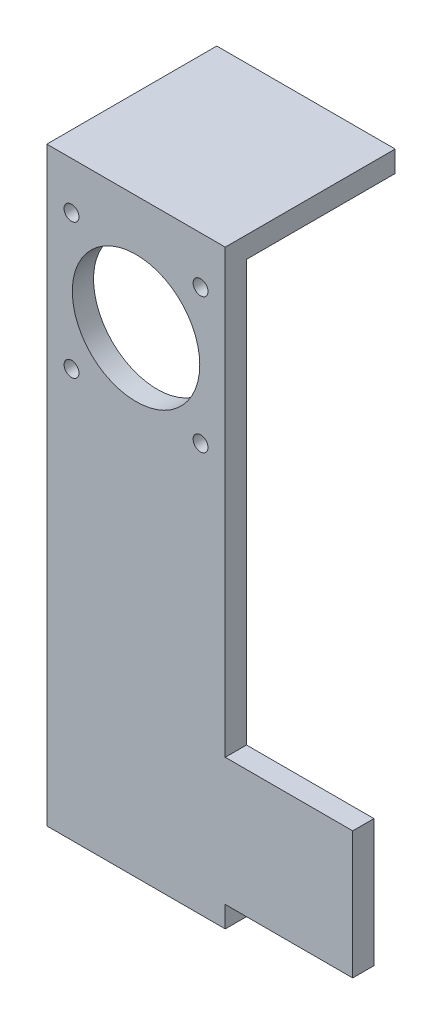
ISO-10303-21;
HEADER;
FILE_DESCRIPTION(('STEP AP214'),'2;1');
FILE_NAME('part.step','',(''),(''),'','','');
FILE_SCHEMA(('AUTOMOTIVE_DESIGN { 1 0 10303 214 1 1 1 1 }'));
ENDSEC;
DATA;
#1=APPLICATION_CONTEXT('core data for automotive mechanical design processes');
#2=APPLICATION_PROTOCOL_DEFINITION('international standard','automotive_design',2000,#1);
#3=PRODUCT_CONTEXT('',#1,'mechanical');
#4=PRODUCT('Part','Part','',(#3));
#5=PRODUCT_RELATED_PRODUCT_CATEGORY('part','',(#4));
#6=PRODUCT_DEFINITION_FORMATION('','',#4);
#7=PRODUCT_DEFINITION_CONTEXT('part definition',#1,'design');
#8=PRODUCT_DEFINITION('design','',#6,#7);
#9=PRODUCT_DEFINITION_SHAPE('','',#8);
#10=(LENGTH_UNIT() NAMED_UNIT(*) SI_UNIT(.MILLI.,.METRE.));
#11=(NAMED_UNIT(*) PLANE_ANGLE_UNIT() SI_UNIT($,.RADIAN.));
#12=(NAMED_UNIT(*) SI_UNIT($,.STERADIAN.) SOLID_ANGLE_UNIT());
#13=UNCERTAINTY_MEASURE_WITH_UNIT(LENGTH_MEASURE(1.E-05),#10,'distance_accuracy_value','');
#14=(GEOMETRIC_REPRESENTATION_CONTEXT(3) GLOBAL_UNCERTAINTY_ASSIGNED_CONTEXT((#13)) GLOBAL_UNIT_ASSIGNED_CONTEXT((#10,
#11,#12)) REPRESENTATION_CONTEXT('',''));
#15=CARTESIAN_POINT('',(0.,0.,0.));
#16=DIRECTION('',(0.,0.,1.));
#17=DIRECTION('',(1.,0.,0.));
#18=AXIS2_PLACEMENT_3D('',#15,#16,#17);
#19=CARTESIAN_POINT('',(51.,0.,5.));
#20=DIRECTION('',(-1.,0.,0.));
#21=DIRECTION('',(0.,0.,1.));
#22=AXIS2_PLACEMENT_3D('',#19,#20,#21);
#23=PLANE('',#22);
#24=DIRECTION('',(0.,1.,0.));
#25=VECTOR('',#24,1.);
#26=CARTESIAN_POINT('',(51.,0.,0.));
#27=LINE('',#26,#25);
#28=CARTESIAN_POINT('',(51.,-107.,0.));
#29=VERTEX_POINT('',#28);
#30=CARTESIAN_POINT('',(51.,-77.,0.));
#31=VERTEX_POINT('',#30);
#32=EDGE_CURVE('E156',#29,#31,#27,.T.);
#33=ORIENTED_EDGE('',*,*,#32,.T.);
#34=DIRECTION('',(0.,0.,-1.));
#35=VECTOR('',#34,1.);
#36=CARTESIAN_POINT('',(51.,-77.,5.));
#37=LINE('',#36,#35);
#38=CARTESIAN_POINT('',(51.,-77.,5.));
#39=VERTEX_POINT('',#38);
#40=EDGE_CURVE('E11',#39,#31,#37,.T.);
#41=ORIENTED_EDGE('',*,*,#40,.F.);
#42=DIRECTION('',(0.,1.,0.));
#43=VECTOR('',#42,1.);
#44=CARTESIAN_POINT('',(51.,0.,5.));
#45=LINE('',#44,#43);
#46=CARTESIAN_POINT('',(51.,-107.,5.));
#47=VERTEX_POINT('',#46);
#48=EDGE_CURVE('E148',#47,#39,#45,.T.);
#49=ORIENTED_EDGE('',*,*,#48,.F.);
#50=DIRECTION('',(0.,0.,-1.));
#51=VECTOR('',#50,1.);
#52=CARTESIAN_POINT('',(51.,-107.,5.));
#53=LINE('',#52,#51);
#54=EDGE_CURVE('E58',#47,#29,#53,.T.);
#55=ORIENTED_EDGE('',*,*,#54,.T.);
#56=EDGE_LOOP('',(#33,#41,#49,#55));
#57=FACE_BOUND('',#56,.T.);
#58=ADVANCED_FACE('F41',(#57),#23,.F.);
#59=CARTESIAN_POINT('',(0.,-77.,5.));
#60=DIRECTION('',(0.,-1.,0.));
#61=DIRECTION('',(0.,0.,-1.));
#62=AXIS2_PLACEMENT_3D('',#59,#60,#61);
#63=PLANE('',#62);
#64=DIRECTION('',(-1.,0.,0.));
#65=VECTOR('',#64,1.);
#66=CARTESIAN_POINT('',(0.,-77.,0.));
#67=LINE('',#66,#65);
#68=CARTESIAN_POINT('',(21.,-77.,0.));
#69=VERTEX_POINT('',#68);
#70=EDGE_CURVE('E265',#31,#69,#67,.T.);
#71=ORIENTED_EDGE('',*,*,#70,.T.);
#72=DIRECTION('',(0.,0.,-1.));
#73=VECTOR('',#72,1.);
#74=CARTESIAN_POINT('',(21.,-77.,5.));
#75=LINE('',#74,#73);
#76=CARTESIAN_POINT('',(21.,-77.,5.));
#77=VERTEX_POINT('',#76);
#78=EDGE_CURVE('E50',#77,#69,#75,.T.);
#79=ORIENTED_EDGE('',*,*,#78,.F.);
#80=DIRECTION('',(-1.,0.,0.));
#81=VECTOR('',#80,1.);
#82=CARTESIAN_POINT('',(0.,-77.,5.));
#83=LINE('',#82,#81);
#84=EDGE_CURVE('E94',#39,#77,#83,.T.);
#85=ORIENTED_EDGE('',*,*,#84,.F.);
#86=ORIENTED_EDGE('',*,*,#40,.T.);
#87=EDGE_LOOP('',(#71,#79,#85,#86));
#88=FACE_BOUND('',#87,.T.);
#89=ADVANCED_FACE('F266',(#88),#63,.F.);
#90=CARTESIAN_POINT('',(21.,0.,5.));
#91=DIRECTION('',(1.,0.,0.));
#92=DIRECTION('',(0.,1.,0.));
#93=AXIS2_PLACEMENT_3D('',#90,#91,#92);
#94=PLANE('',#93);
#95=DIRECTION('',(0.,-1.,0.));
#96=VECTOR('',#95,1.);
#97=CARTESIAN_POINT('',(21.,0.,0.));
#98=LINE('',#97,#96);
#99=CARTESIAN_POINT('',(21.,22.,0.));
#100=VERTEX_POINT('',#99);
#101=EDGE_CURVE('E221',#100,#69,#98,.T.);
#102=ORIENTED_EDGE('',*,*,#101,.F.);
#103=DIRECTION('',(0.,0.,1.));
#104=VECTOR('',#103,1.);
#105=CARTESIAN_POINT('',(21.,22.,-35.));
#106=LINE('',#105,#104);
#107=CARTESIAN_POINT('',(21.,22.,-35.));
#108=VERTEX_POINT('',#107);
#109=EDGE_CURVE('E153',#108,#100,#106,.T.);
#110=ORIENTED_EDGE('',*,*,#109,.F.);
#111=DIRECTION('',(0.,-1.,0.));
#112=VECTOR('',#111,1.);
#113=CARTESIAN_POINT('',(21.,22.,-35.));
#114=LINE('',#113,#112);
#115=CARTESIAN_POINT('',(21.,27.,-35.));
#116=VERTEX_POINT('',#115);
#117=EDGE_CURVE('E180',#116,#108,#114,.T.);
#118=ORIENTED_EDGE('',*,*,#117,.F.);
#119=DIRECTION('',(0.,0.,1.));
#120=VECTOR('',#119,1.);
#121=CARTESIAN_POINT('',(21.,27.,-35.));
#122=LINE('',#121,#120);
#123=CARTESIAN_POINT('',(21.,27.,5.));
#124=VERTEX_POINT('',#123);
#125=EDGE_CURVE('E165',#116,#124,#122,.T.);
#126=ORIENTED_EDGE('',*,*,#125,.T.);
#127=DIRECTION('',(0.,-1.,0.));
#128=VECTOR('',#127,1.);
#129=CARTESIAN_POINT('',(21.,0.,5.));
#130=LINE('',#129,#128);
#131=EDGE_CURVE('E135',#124,#77,#130,.T.);
#132=ORIENTED_EDGE('',*,*,#131,.T.);
#133=ORIENTED_EDGE('',*,*,#78,.T.);
#134=EDGE_LOOP('',(#102,#110,#118,#126,#132,#133));
#135=FACE_BOUND('',#134,.T.);
#136=ADVANCED_FACE('F264',(#135),#94,.T.);
#137=CARTESIAN_POINT('',(-21.,0.,5.));
#138=DIRECTION('',(1.,0.,0.));
#139=DIRECTION('',(0.,1.,0.));
#140=AXIS2_PLACEMENT_3D('',#137,#138,#139);
#141=PLANE('',#140);
#142=DIRECTION('',(0.,-1.,0.));
#143=VECTOR('',#142,1.);
#144=CARTESIAN_POINT('',(-21.,0.,0.));
#145=LINE('',#144,#143);
#146=CARTESIAN_POINT('',(-21.,22.,0.));
#147=VERTEX_POINT('',#146);
#148=CARTESIAN_POINT('',(-21.,-112.,0.));
#149=VERTEX_POINT('',#148);
#150=EDGE_CURVE('E220',#147,#149,#145,.T.);
#151=ORIENTED_EDGE('',*,*,#150,.T.);
#152=DIRECTION('',(0.,0.,-1.));
#153=VECTOR('',#152,1.);
#154=CARTESIAN_POINT('',(-21.,-112.,5.));
#155=LINE('',#154,#153);
#156=CARTESIAN_POINT('',(-21.,-112.,5.));
#157=VERTEX_POINT('',#156);
#158=EDGE_CURVE('E129',#157,#149,#155,.T.);
#159=ORIENTED_EDGE('',*,*,#158,.F.);
#160=DIRECTION('',(0.,-1.,0.));
#161=VECTOR('',#160,1.);
#162=CARTESIAN_POINT('',(-21.,0.,5.));
#163=LINE('',#162,#161);
#164=CARTESIAN_POINT('',(-21.,27.,5.));
#165=VERTEX_POINT('',#164);
#166=EDGE_CURVE('E115',#165,#157,#163,.T.);
#167=ORIENTED_EDGE('',*,*,#166,.F.);
#168=DIRECTION('',(0.,0.,1.));
#169=VECTOR('',#168,1.);
#170=CARTESIAN_POINT('',(-21.,27.,-35.));
#171=LINE('',#170,#169);
#172=CARTESIAN_POINT('',(-21.,27.,-35.));
#173=VERTEX_POINT('',#172);
#174=EDGE_CURVE('E161',#173,#165,#171,.T.);
#175=ORIENTED_EDGE('',*,*,#174,.F.);
#176=DIRECTION('',(0.,1.,0.));
#177=VECTOR('',#176,1.);
#178=CARTESIAN_POINT('',(-21.,22.,-35.));
#179=LINE('',#178,#177);
#180=CARTESIAN_POINT('',(-21.,22.,-35.));
#181=VERTEX_POINT('',#180);
#182=EDGE_CURVE('E172',#181,#173,#179,.T.);
#183=ORIENTED_EDGE('',*,*,#182,.F.);
#184=DIRECTION('',(0.,0.,1.));
#185=VECTOR('',#184,1.);
#186=CARTESIAN_POINT('',(-21.,22.,-35.));
#187=LINE('',#186,#185);
#188=EDGE_CURVE('E157',#181,#147,#187,.T.);
#189=ORIENTED_EDGE('',*,*,#188,.T.);
#190=EDGE_LOOP('',(#151,#159,#167,#175,#183,#189));
#191=FACE_BOUND('',#190,.T.);
#192=ADVANCED_FACE('F223',(#191),#141,.F.);
#193=CARTESIAN_POINT('',(0.,-112.,5.));
#194=DIRECTION('',(0.,1.,0.));
#195=DIRECTION('',(0.,0.,1.));
#196=AXIS2_PLACEMENT_3D('',#193,#194,#195);
#197=PLANE('',#196);
#198=DIRECTION('',(1.,0.,0.));
#199=VECTOR('',#198,1.);
#200=CARTESIAN_POINT('',(0.,-112.,0.));
#201=LINE('',#200,#199);
#202=CARTESIAN_POINT('',(21.,-112.,0.));
#203=VERTEX_POINT('',#202);
#204=EDGE_CURVE('E125',#149,#203,#201,.T.);
#205=ORIENTED_EDGE('',*,*,#204,.T.);
#206=DIRECTION('',(0.,0.,-1.));
#207=VECTOR('',#206,1.);
#208=CARTESIAN_POINT('',(21.,-112.,5.));
#209=LINE('',#208,#207);
#210=CARTESIAN_POINT('',(21.,-112.,5.));
#211=VERTEX_POINT('',#210);
#212=EDGE_CURVE('E122',#211,#203,#209,.T.);
#213=ORIENTED_EDGE('',*,*,#212,.F.);
#214=DIRECTION('',(1.,0.,0.));
#215=VECTOR('',#214,1.);
#216=CARTESIAN_POINT('',(0.,-112.,5.));
#217=LINE('',#216,#215);
#218=EDGE_CURVE('E106',#157,#211,#217,.T.);
#219=ORIENTED_EDGE('',*,*,#218,.F.);
#220=ORIENTED_EDGE('',*,*,#158,.T.);
#221=EDGE_LOOP('',(#205,#213,#219,#220));
#222=FACE_BOUND('',#221,.T.);
#223=ADVANCED_FACE('F123',(#222),#197,.F.);
#224=CARTESIAN_POINT('',(21.,-107.,0.));
#225=VERTEX_POINT('',#224);
#226=EDGE_CURVE('E229',#225,#203,#98,.T.);
#227=ORIENTED_EDGE('',*,*,#226,.F.);
#228=DIRECTION('',(0.,0.,-1.));
#229=VECTOR('',#228,1.);
#230=CARTESIAN_POINT('',(21.,-107.,5.));
#231=LINE('',#230,#229);
#232=CARTESIAN_POINT('',(21.,-107.,5.));
#233=VERTEX_POINT('',#232);
#234=EDGE_CURVE('E82',#233,#225,#231,.T.);
#235=ORIENTED_EDGE('',*,*,#234,.F.);
#236=EDGE_CURVE('E112',#233,#211,#130,.T.);
#237=ORIENTED_EDGE('',*,*,#236,.T.);
#238=ORIENTED_EDGE('',*,*,#212,.T.);
#239=EDGE_LOOP('',(#227,#235,#237,#238));
#240=FACE_BOUND('',#239,.T.);
#241=ADVANCED_FACE('F131',(#240),#94,.T.);
#242=CARTESIAN_POINT('',(15.190466427015,15.9138219711586,5.));
#243=DIRECTION('',(0.,0.,-1.));
#244=DIRECTION('',(-1.,0.,0.));
#245=AXIS2_PLACEMENT_3D('',#242,#243,#244);
#246=CYLINDRICAL_SURFACE('',#245,1.75);
#247=CARTESIAN_POINT('',(15.190466427015,15.9138219711586,5.));
#248=DIRECTION('',(0.,0.,1.));
#249=DIRECTION('',(1.,0.,0.));
#250=AXIS2_PLACEMENT_3D('',#247,#248,#249);
#251=CIRCLE('',#250,1.75);
#252=CARTESIAN_POINT('',(16.940466427015,15.9138219711586,5.));
#253=VERTEX_POINT('',#252);
#254=EDGE_CURVE('E297',#253,#253,#251,.T.);
#255=ORIENTED_EDGE('',*,*,#254,.T.);
#256=EDGE_LOOP('',(#255));
#257=FACE_BOUND('',#256,.T.);
#258=CARTESIAN_POINT('',(15.190466427015,15.9138219711586,0.));
#259=DIRECTION('',(0.,0.,1.));
#260=DIRECTION('',(1.,0.,0.));
#261=AXIS2_PLACEMENT_3D('',#258,#259,#260);
#262=CIRCLE('',#261,1.75);
#263=CARTESIAN_POINT('',(16.940466427015,15.9138219711586,0.));
#264=VERTEX_POINT('',#263);
#265=EDGE_CURVE('E249',#264,#264,#262,.T.);
#266=ORIENTED_EDGE('',*,*,#265,.F.);
#267=EDGE_LOOP('',(#266));
#268=FACE_BOUND('',#267,.T.);
#269=ADVANCED_FACE('F333',(#257,#268),#246,.F.);
#270=CARTESIAN_POINT('',(15.190466427015,-15.9138219711586,5.));
#271=DIRECTION('',(0.,0.,-1.));
#272=DIRECTION('',(-1.,0.,0.));
#273=AXIS2_PLACEMENT_3D('',#270,#271,#272);
#274=CYLINDRICAL_SURFACE('',#273,1.75);
#275=CARTESIAN_POINT('',(15.190466427015,-15.9138219711586,5.));
#276=DIRECTION('',(0.,0.,1.));
#277=DIRECTION('',(1.,0.,0.));
#278=AXIS2_PLACEMENT_3D('',#275,#276,#277);
#279=CIRCLE('',#278,1.75);
#280=CARTESIAN_POINT('',(16.940466427015,-15.9138219711586,5.));
#281=VERTEX_POINT('',#280);
#282=EDGE_CURVE('E301',#281,#281,#279,.T.);
#283=ORIENTED_EDGE('',*,*,#282,.T.);
#284=EDGE_LOOP('',(#283));
#285=FACE_BOUND('',#284,.T.);
#286=CARTESIAN_POINT('',(15.190466427015,-15.9138219711586,0.));
#287=DIRECTION('',(0.,0.,1.));
#288=DIRECTION('',(1.,0.,0.));
#289=AXIS2_PLACEMENT_3D('',#286,#287,#288);
#290=CIRCLE('',#289,1.75);
#291=CARTESIAN_POINT('',(16.940466427015,-15.9138219711586,0.));
#292=VERTEX_POINT('',#291);
#293=EDGE_CURVE('E245',#292,#292,#290,.T.);
#294=ORIENTED_EDGE('',*,*,#293,.F.);
#295=EDGE_LOOP('',(#294));
#296=FACE_BOUND('',#295,.T.);
#297=ADVANCED_FACE('F336',(#285,#296),#274,.F.);
#298=CARTESIAN_POINT('',(-15.190466427015,-15.9138219711586,5.));
#299=DIRECTION('',(0.,0.,-1.));
#300=DIRECTION('',(-1.,0.,0.));
#301=AXIS2_PLACEMENT_3D('',#298,#299,#300);
#302=CYLINDRICAL_SURFACE('',#301,1.75);
#303=CARTESIAN_POINT('',(-15.190466427015,-15.9138219711586,5.));
#304=DIRECTION('',(0.,0.,1.));
#305=DIRECTION('',(1.,0.,0.));
#306=AXIS2_PLACEMENT_3D('',#303,#304,#305);
#307=CIRCLE('',#306,1.75);
#308=CARTESIAN_POINT('',(-13.440466427015,-15.9138219711586,5.));
#309=VERTEX_POINT('',#308);
#310=EDGE_CURVE('E305',#309,#309,#307,.T.);
#311=ORIENTED_EDGE('',*,*,#310,.T.);
#312=EDGE_LOOP('',(#311));
#313=FACE_BOUND('',#312,.T.);
#314=CARTESIAN_POINT('',(-15.190466427015,-15.9138219711586,0.));
#315=DIRECTION('',(0.,0.,1.));
#316=DIRECTION('',(1.,0.,0.));
#317=AXIS2_PLACEMENT_3D('',#314,#315,#316);
#318=CIRCLE('',#317,1.75);
#319=CARTESIAN_POINT('',(-13.440466427015,-15.9138219711586,0.));
#320=VERTEX_POINT('',#319);
#321=EDGE_CURVE('E241',#320,#320,#318,.T.);
#322=ORIENTED_EDGE('',*,*,#321,.F.);
#323=EDGE_LOOP('',(#322));
#324=FACE_BOUND('',#323,.T.);
#325=ADVANCED_FACE('F283',(#313,#324),#302,.F.);
#326=CARTESIAN_POINT('',(-15.190466427015,15.9138219711586,5.));
#327=DIRECTION('',(0.,0.,-1.));
#328=DIRECTION('',(-1.,0.,0.));
#329=AXIS2_PLACEMENT_3D('',#326,#327,#328);
#330=CYLINDRICAL_SURFACE('',#329,1.75);
#331=CARTESIAN_POINT('',(-15.190466427015,15.9138219711586,5.));
#332=DIRECTION('',(0.,0.,1.));
#333=DIRECTION('',(1.,0.,0.));
#334=AXIS2_PLACEMENT_3D('',#331,#332,#333);
#335=CIRCLE('',#334,1.75);
#336=CARTESIAN_POINT('',(-13.440466427015,15.9138219711586,5.));
#337=VERTEX_POINT('',#336);
#338=EDGE_CURVE('E137',#337,#337,#335,.T.);
#339=ORIENTED_EDGE('',*,*,#338,.T.);
#340=EDGE_LOOP('',(#339));
#341=FACE_BOUND('',#340,.T.);
#342=CARTESIAN_POINT('',(-15.190466427015,15.9138219711586,0.));
#343=DIRECTION('',(0.,0.,1.));
#344=DIRECTION('',(1.,0.,0.));
#345=AXIS2_PLACEMENT_3D('',#342,#343,#344);
#346=CIRCLE('',#345,1.75);
#347=CARTESIAN_POINT('',(-13.440466427015,15.9138219711586,0.));
#348=VERTEX_POINT('',#347);
#349=EDGE_CURVE('E237',#348,#348,#346,.T.);
#350=ORIENTED_EDGE('',*,*,#349,.F.);
#351=EDGE_LOOP('',(#350));
#352=FACE_BOUND('',#351,.T.);
#353=ADVANCED_FACE('F275',(#341,#352),#330,.F.);
#354=CARTESIAN_POINT('',(0.,-107.,5.));
#355=DIRECTION('',(0.,-1.,0.));
#356=DIRECTION('',(1.,0.,0.));
#357=AXIS2_PLACEMENT_3D('',#354,#355,#356);
#358=PLANE('',#357);
#359=DIRECTION('',(-1.,0.,0.));
#360=VECTOR('',#359,1.);
#361=CARTESIAN_POINT('',(0.,-107.,0.));
#362=LINE('',#361,#360);
#363=EDGE_CURVE('E233',#29,#225,#362,.T.);
#364=ORIENTED_EDGE('',*,*,#363,.F.);
#365=ORIENTED_EDGE('',*,*,#54,.F.);
#366=DIRECTION('',(-1.,0.,0.));
#367=VECTOR('',#366,1.);
#368=CARTESIAN_POINT('',(0.,-107.,5.));
#369=LINE('',#368,#367);
#370=EDGE_CURVE('E133',#47,#233,#369,.T.);
#371=ORIENTED_EDGE('',*,*,#370,.T.);
#372=ORIENTED_EDGE('',*,*,#234,.T.);
#373=EDGE_LOOP('',(#364,#365,#371,#372));
#374=FACE_BOUND('',#373,.T.);
#375=ADVANCED_FACE('F272',(#374),#358,.T.);
#376=CARTESIAN_POINT('',(0.,0.,5.));
#377=DIRECTION('',(0.,0.,-1.));
#378=DIRECTION('',(-1.,0.,0.));
#379=AXIS2_PLACEMENT_3D('',#376,#377,#378);
#380=CYLINDRICAL_SURFACE('',#379,15.);
#381=CARTESIAN_POINT('',(0.,0.,5.));
#382=DIRECTION('',(0.,0.,1.));
#383=DIRECTION('',(1.,0.,0.));
#384=AXIS2_PLACEMENT_3D('',#381,#382,#383);
#385=CIRCLE('',#384,15.);
#386=CARTESIAN_POINT('',(15.,0.,5.));
#387=VERTEX_POINT('',#386);
#388=EDGE_CURVE('E258',#387,#387,#385,.T.);
#389=ORIENTED_EDGE('',*,*,#388,.T.);
#390=EDGE_LOOP('',(#389));
#391=FACE_BOUND('',#390,.T.);
#392=CARTESIAN_POINT('',(0.,0.,0.));
#393=DIRECTION('',(0.,0.,1.));
#394=DIRECTION('',(1.,0.,0.));
#395=AXIS2_PLACEMENT_3D('',#392,#393,#394);
#396=CIRCLE('',#395,15.);
#397=CARTESIAN_POINT('',(15.,0.,0.));
#398=VERTEX_POINT('',#397);
#399=EDGE_CURVE('E150',#398,#398,#396,.T.);
#400=ORIENTED_EDGE('',*,*,#399,.F.);
#401=EDGE_LOOP('',(#400));
#402=FACE_BOUND('',#401,.T.);
#403=ADVANCED_FACE('F274',(#391,#402),#380,.F.);
#404=CARTESIAN_POINT('',(0.,0.,5.));
#405=DIRECTION('',(0.,0.,1.));
#406=DIRECTION('',(1.,0.,0.));
#407=AXIS2_PLACEMENT_3D('',#404,#405,#406);
#408=PLANE('',#407);
#409=ORIENTED_EDGE('',*,*,#48,.T.);
#410=ORIENTED_EDGE('',*,*,#84,.T.);
#411=ORIENTED_EDGE('',*,*,#131,.F.);
#412=DIRECTION('',(1.,0.,0.));
#413=VECTOR('',#412,1.);
#414=CARTESIAN_POINT('',(-21.,27.,5.));
#415=LINE('',#414,#413);
#416=EDGE_CURVE('E184',#165,#124,#415,.T.);
#417=ORIENTED_EDGE('',*,*,#416,.F.);
#418=ORIENTED_EDGE('',*,*,#166,.T.);
#419=ORIENTED_EDGE('',*,*,#218,.T.);
#420=ORIENTED_EDGE('',*,*,#236,.F.);
#421=ORIENTED_EDGE('',*,*,#370,.F.);
#422=EDGE_LOOP('',(#409,#410,#411,#417,#418,#419,#420,#421));
#423=FACE_BOUND('',#422,.T.);
#424=ORIENTED_EDGE('',*,*,#338,.F.);
#425=EDGE_LOOP('',(#424));
#426=FACE_BOUND('',#425,.T.);
#427=ORIENTED_EDGE('',*,*,#310,.F.);
#428=EDGE_LOOP('',(#427));
#429=FACE_BOUND('',#428,.T.);
#430=ORIENTED_EDGE('',*,*,#282,.F.);
#431=EDGE_LOOP('',(#430));
#432=FACE_BOUND('',#431,.T.);
#433=ORIENTED_EDGE('',*,*,#254,.F.);
#434=EDGE_LOOP('',(#433));
#435=FACE_BOUND('',#434,.T.);
#436=ORIENTED_EDGE('',*,*,#388,.F.);
#437=EDGE_LOOP('',(#436));
#438=FACE_BOUND('',#437,.T.);
#439=ADVANCED_FACE('F108',(#423,#426,#429,#432,#435,#438),#408,.T.);
#440=CARTESIAN_POINT('',(0.,0.,0.));
#441=DIRECTION('',(0.,0.,1.));
#442=DIRECTION('',(1.,0.,0.));
#443=AXIS2_PLACEMENT_3D('',#440,#441,#442);
#444=PLANE('',#443);
#445=ORIENTED_EDGE('',*,*,#32,.F.);
#446=ORIENTED_EDGE('',*,*,#363,.T.);
#447=ORIENTED_EDGE('',*,*,#226,.T.);
#448=ORIENTED_EDGE('',*,*,#204,.F.);
#449=ORIENTED_EDGE('',*,*,#150,.F.);
#450=DIRECTION('',(1.,0.,0.));
#451=VECTOR('',#450,1.);
#452=CARTESIAN_POINT('',(0.,22.,0.));
#453=LINE('',#452,#451);
#454=EDGE_CURVE('E211',#147,#100,#453,.T.);
#455=ORIENTED_EDGE('',*,*,#454,.T.);
#456=ORIENTED_EDGE('',*,*,#101,.T.);
#457=ORIENTED_EDGE('',*,*,#70,.F.);
#458=EDGE_LOOP('',(#445,#446,#447,#448,#449,#455,#456,#457));
#459=FACE_BOUND('',#458,.T.);
#460=ORIENTED_EDGE('',*,*,#349,.T.);
#461=EDGE_LOOP('',(#460));
#462=FACE_BOUND('',#461,.T.);
#463=ORIENTED_EDGE('',*,*,#321,.T.);
#464=EDGE_LOOP('',(#463));
#465=FACE_BOUND('',#464,.T.);
#466=ORIENTED_EDGE('',*,*,#293,.T.);
#467=EDGE_LOOP('',(#466));
#468=FACE_BOUND('',#467,.T.);
#469=ORIENTED_EDGE('',*,*,#265,.T.);
#470=EDGE_LOOP('',(#469));
#471=FACE_BOUND('',#470,.T.);
#472=ORIENTED_EDGE('',*,*,#399,.T.);
#473=EDGE_LOOP('',(#472));
#474=FACE_BOUND('',#473,.T.);
#475=ADVANCED_FACE('F224',(#459,#462,#465,#468,#471,#474),#444,.F.);
#476=CARTESIAN_POINT('',(-21.,22.,-35.));
#477=DIRECTION('',(0.,1.,0.));
#478=DIRECTION('',(0.,0.,1.));
#479=AXIS2_PLACEMENT_3D('',#476,#477,#478);
#480=PLANE('',#479);
#481=ORIENTED_EDGE('',*,*,#454,.F.);
#482=ORIENTED_EDGE('',*,*,#188,.F.);
#483=DIRECTION('',(-1.,0.,0.));
#484=VECTOR('',#483,1.);
#485=CARTESIAN_POINT('',(-21.,22.,-35.));
#486=LINE('',#485,#484);
#487=EDGE_CURVE('E176',#108,#181,#486,.T.);
#488=ORIENTED_EDGE('',*,*,#487,.F.);
#489=ORIENTED_EDGE('',*,*,#109,.T.);
#490=EDGE_LOOP('',(#481,#482,#488,#489));
#491=FACE_BOUND('',#490,.T.);
#492=ADVANCED_FACE('F212',(#491),#480,.F.);
#493=CARTESIAN_POINT('',(-21.,27.,-35.));
#494=DIRECTION('',(0.,-1.,0.));
#495=DIRECTION('',(1.,0.,0.));
#496=AXIS2_PLACEMENT_3D('',#493,#494,#495);
#497=PLANE('',#496);
#498=ORIENTED_EDGE('',*,*,#174,.T.);
#499=ORIENTED_EDGE('',*,*,#416,.T.);
#500=ORIENTED_EDGE('',*,*,#125,.F.);
#501=DIRECTION('',(1.,0.,0.));
#502=VECTOR('',#501,1.);
#503=CARTESIAN_POINT('',(-21.,27.,-35.));
#504=LINE('',#503,#502);
#505=EDGE_CURVE('E168',#173,#116,#504,.T.);
#506=ORIENTED_EDGE('',*,*,#505,.F.);
#507=EDGE_LOOP('',(#498,#499,#500,#506));
#508=FACE_BOUND('',#507,.T.);
#509=ADVANCED_FACE('F190',(#508),#497,.F.);
#510=CARTESIAN_POINT('',(0.,0.,-35.));
#511=DIRECTION('',(0.,0.,-1.));
#512=DIRECTION('',(-1.,0.,0.));
#513=AXIS2_PLACEMENT_3D('',#510,#511,#512);
#514=PLANE('',#513);
#515=ORIENTED_EDGE('',*,*,#117,.T.);
#516=ORIENTED_EDGE('',*,*,#487,.T.);
#517=ORIENTED_EDGE('',*,*,#182,.T.);
#518=ORIENTED_EDGE('',*,*,#505,.T.);
#519=EDGE_LOOP('',(#515,#516,#517,#518));
#520=FACE_BOUND('',#519,.T.);
#521=ADVANCED_FACE('F416',(#520),#514,.T.);
#522=CLOSED_SHELL('',(#58,#89,#136,#192,#223,#241,#269,#297,#325,#353,#375,#403,#439,#475,#492,
#509,#521));
#523=MANIFOLD_SOLID_BREP('B2',#522);
#524=ADVANCED_BREP_SHAPE_REPRESENTATION('',(#18,#523),#14);
#525=SHAPE_DEFINITION_REPRESENTATION(#9,#524);
ENDSEC;
END-ISO-10303-21;
